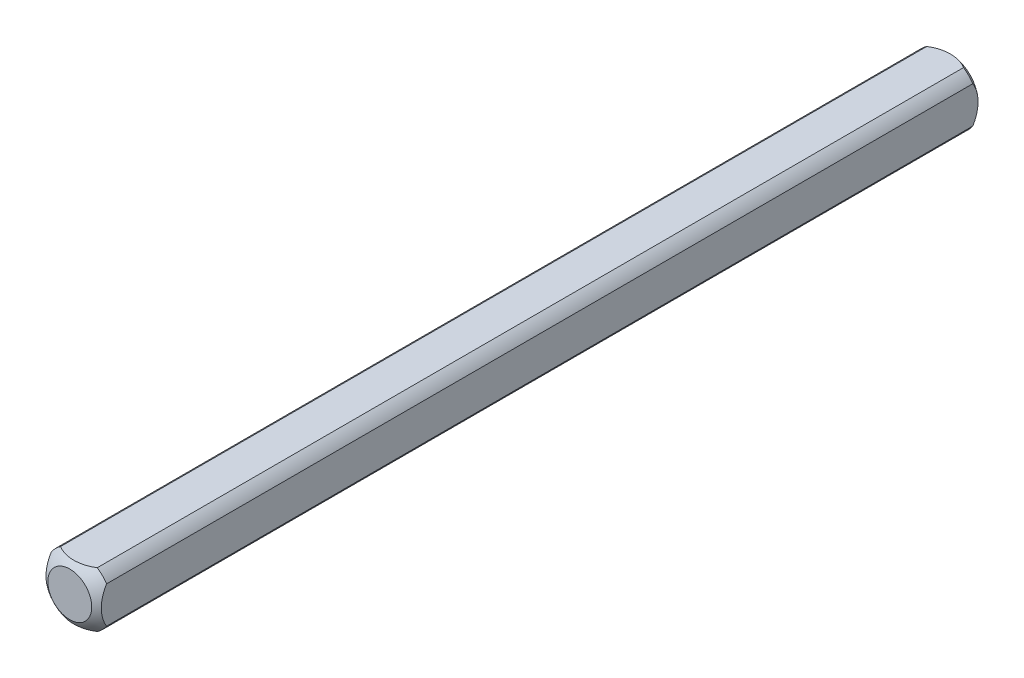
ISO-10303-21;
HEADER;
FILE_DESCRIPTION(('STEP AP214'),'2;1');
FILE_NAME('part.step','',(''),(''),'','','');
FILE_SCHEMA(('AUTOMOTIVE_DESIGN { 1 0 10303 214 1 1 1 1 }'));
ENDSEC;
DATA;
#1=APPLICATION_CONTEXT('core data for automotive mechanical design processes');
#2=APPLICATION_PROTOCOL_DEFINITION('international standard','automotive_design',2000,#1);
#3=PRODUCT_CONTEXT('',#1,'mechanical');
#4=PRODUCT('Part','Part','',(#3));
#5=PRODUCT_RELATED_PRODUCT_CATEGORY('part','',(#4));
#6=PRODUCT_DEFINITION_FORMATION('','',#4);
#7=PRODUCT_DEFINITION_CONTEXT('part definition',#1,'design');
#8=PRODUCT_DEFINITION('design','',#6,#7);
#9=PRODUCT_DEFINITION_SHAPE('','',#8);
#10=(LENGTH_UNIT() NAMED_UNIT(*) SI_UNIT(.MILLI.,.METRE.));
#11=(NAMED_UNIT(*) PLANE_ANGLE_UNIT() SI_UNIT($,.RADIAN.));
#12=(NAMED_UNIT(*) SI_UNIT($,.STERADIAN.) SOLID_ANGLE_UNIT());
#13=UNCERTAINTY_MEASURE_WITH_UNIT(LENGTH_MEASURE(1.E-05),#10,'distance_accuracy_value','');
#14=(GEOMETRIC_REPRESENTATION_CONTEXT(3) GLOBAL_UNCERTAINTY_ASSIGNED_CONTEXT((#13)) GLOBAL_UNIT_ASSIGNED_CONTEXT((#10,
#11,#12)) REPRESENTATION_CONTEXT('',''));
#15=CARTESIAN_POINT('',(0.,0.,0.));
#16=DIRECTION('',(0.,0.,1.));
#17=DIRECTION('',(1.,0.,0.));
#18=AXIS2_PLACEMENT_3D('',#15,#16,#17);
#19=CARTESIAN_POINT('',(-3.175,-3.175,50.8));
#20=DIRECTION('',(1.,0.,0.));
#21=DIRECTION('',(0.,0.,-1.));
#22=AXIS2_PLACEMENT_3D('',#19,#20,#21);
#23=PLANE('',#22);
#24=CARTESIAN_POINT('',(-3.175,0.,4.409725449428));
#25=DIRECTION('',(1.,0.,0.));
#26=DIRECTION('',(0.,0.,-1.));
#27=AXIS2_PLACEMENT_3D('',#24,#25,#26);
#28=CIRCLE('',#27,3.96557372898298);
#29=CARTESIAN_POINT('',(-3.175,-2.10605674187568,1.04962128437597));
#30=VERTEX_POINT('',#29);
#31=CARTESIAN_POINT('',(-3.175,2.10605674187568,1.04962128437597));
#32=VERTEX_POINT('',#31);
#33=EDGE_CURVE('E47',#30,#32,#28,.T.);
#34=ORIENTED_EDGE('',*,*,#33,.F.);
#35=DIRECTION('',(0.,0.,-1.));
#36=VECTOR('',#35,1.);
#37=CARTESIAN_POINT('',(-3.175,-2.10605674187568,50.8));
#38=LINE('',#37,#36);
#39=CARTESIAN_POINT('',(-3.175,-2.10605674187568,100.550378715624));
#40=VERTEX_POINT('',#39);
#41=EDGE_CURVE('E40',#40,#30,#38,.T.);
#42=ORIENTED_EDGE('',*,*,#41,.F.);
#43=CARTESIAN_POINT('',(-3.175,0.,97.190274550572));
#44=DIRECTION('',(-1.,0.,0.));
#45=DIRECTION('',(0.,0.,1.));
#46=AXIS2_PLACEMENT_3D('',#43,#44,#45);
#47=CIRCLE('',#46,3.96557372898298);
#48=CARTESIAN_POINT('',(-3.175,2.10605674187568,100.550378715624));
#49=VERTEX_POINT('',#48);
#50=EDGE_CURVE('E123',#40,#49,#47,.T.);
#51=ORIENTED_EDGE('',*,*,#50,.T.);
#52=DIRECTION('',(0.,0.,-1.));
#53=VECTOR('',#52,1.);
#54=CARTESIAN_POINT('',(-3.175,2.10605674187568,50.8));
#55=LINE('',#54,#53);
#56=EDGE_CURVE('E111',#32,#49,#55,.F.);
#57=ORIENTED_EDGE('',*,*,#56,.F.);
#58=EDGE_LOOP('',(#34,#42,#51,#57));
#59=FACE_BOUND('',#58,.T.);
#60=ADVANCED_FACE('F33',(#59),#23,.F.);
#61=CARTESIAN_POINT('',(-3.175,-3.175,50.8));
#62=DIRECTION('',(0.,1.,0.));
#63=DIRECTION('',(0.,0.,1.));
#64=AXIS2_PLACEMENT_3D('',#61,#62,#63);
#65=PLANE('',#64);
#66=CARTESIAN_POINT('',(0.,-3.175,4.409725449428));
#67=DIRECTION('',(0.,1.,0.));
#68=DIRECTION('',(0.,0.,1.));
#69=AXIS2_PLACEMENT_3D('',#66,#67,#68);
#70=CIRCLE('',#69,3.96557372898298);
#71=CARTESIAN_POINT('',(2.10605674187568,-3.175,1.04962128437597));
#72=VERTEX_POINT('',#71);
#73=CARTESIAN_POINT('',(-2.10605674187568,-3.175,1.04962128437597));
#74=VERTEX_POINT('',#73);
#75=EDGE_CURVE('E152',#72,#74,#70,.T.);
#76=ORIENTED_EDGE('',*,*,#75,.F.);
#77=DIRECTION('',(0.,0.,-1.));
#78=VECTOR('',#77,1.);
#79=CARTESIAN_POINT('',(2.10605674187568,-3.175,50.8));
#80=LINE('',#79,#78);
#81=CARTESIAN_POINT('',(2.10605674187568,-3.175,100.550378715624));
#82=VERTEX_POINT('',#81);
#83=EDGE_CURVE('E165',#82,#72,#80,.T.);
#84=ORIENTED_EDGE('',*,*,#83,.F.);
#85=CARTESIAN_POINT('',(0.,-3.175,97.190274550572));
#86=DIRECTION('',(0.,-1.,0.));
#87=DIRECTION('',(0.,0.,-1.));
#88=AXIS2_PLACEMENT_3D('',#85,#86,#87);
#89=CIRCLE('',#88,3.96557372898298);
#90=CARTESIAN_POINT('',(-2.10605674187568,-3.175,100.550378715624));
#91=VERTEX_POINT('',#90);
#92=EDGE_CURVE('E134',#82,#91,#89,.T.);
#93=ORIENTED_EDGE('',*,*,#92,.T.);
#94=DIRECTION('',(0.,0.,-1.));
#95=VECTOR('',#94,1.);
#96=CARTESIAN_POINT('',(-2.10605674187568,-3.175,50.8));
#97=LINE('',#96,#95);
#98=EDGE_CURVE('E163',#74,#91,#97,.F.);
#99=ORIENTED_EDGE('',*,*,#98,.F.);
#100=EDGE_LOOP('',(#76,#84,#93,#99));
#101=FACE_BOUND('',#100,.T.);
#102=ADVANCED_FACE('F175',(#101),#65,.F.);
#103=CARTESIAN_POINT('',(3.175,-3.175,50.8));
#104=DIRECTION('',(-1.,0.,0.));
#105=DIRECTION('',(0.,0.,1.));
#106=AXIS2_PLACEMENT_3D('',#103,#104,#105);
#107=PLANE('',#106);
#108=CARTESIAN_POINT('',(3.175,0.,4.409725449428));
#109=DIRECTION('',(-1.,0.,0.));
#110=DIRECTION('',(0.,0.,1.));
#111=AXIS2_PLACEMENT_3D('',#108,#109,#110);
#112=CIRCLE('',#111,3.96557372898298);
#113=CARTESIAN_POINT('',(3.175,2.10605674187568,1.04962128437597));
#114=VERTEX_POINT('',#113);
#115=CARTESIAN_POINT('',(3.175,-2.10605674187568,1.04962128437597));
#116=VERTEX_POINT('',#115);
#117=EDGE_CURVE('E150',#114,#116,#112,.T.);
#118=ORIENTED_EDGE('',*,*,#117,.F.);
#119=DIRECTION('',(0.,0.,-1.));
#120=VECTOR('',#119,1.);
#121=CARTESIAN_POINT('',(3.175,2.10605674187568,50.8));
#122=LINE('',#121,#120);
#123=CARTESIAN_POINT('',(3.175,2.10605674187568,100.550378715624));
#124=VERTEX_POINT('',#123);
#125=EDGE_CURVE('E160',#124,#114,#122,.T.);
#126=ORIENTED_EDGE('',*,*,#125,.F.);
#127=CARTESIAN_POINT('',(3.175,0.,97.190274550572));
#128=DIRECTION('',(1.,0.,0.));
#129=DIRECTION('',(0.,0.,-1.));
#130=AXIS2_PLACEMENT_3D('',#127,#128,#129);
#131=CIRCLE('',#130,3.96557372898298);
#132=CARTESIAN_POINT('',(3.175,-2.10605674187568,100.550378715624));
#133=VERTEX_POINT('',#132);
#134=EDGE_CURVE('E131',#124,#133,#131,.T.);
#135=ORIENTED_EDGE('',*,*,#134,.T.);
#136=DIRECTION('',(0.,0.,-1.));
#137=VECTOR('',#136,1.);
#138=CARTESIAN_POINT('',(3.175,-2.10605674187568,50.8));
#139=LINE('',#138,#137);
#140=EDGE_CURVE('E104',#116,#133,#139,.F.);
#141=ORIENTED_EDGE('',*,*,#140,.F.);
#142=EDGE_LOOP('',(#118,#126,#135,#141));
#143=FACE_BOUND('',#142,.T.);
#144=ADVANCED_FACE('F182',(#143),#107,.F.);
#145=CARTESIAN_POINT('',(-3.175,3.175,50.8));
#146=DIRECTION('',(0.,-1.,0.));
#147=DIRECTION('',(0.,0.,-1.));
#148=AXIS2_PLACEMENT_3D('',#145,#146,#147);
#149=PLANE('',#148);
#150=CARTESIAN_POINT('',(0.,3.175,4.409725449428));
#151=DIRECTION('',(0.,-1.,0.));
#152=DIRECTION('',(0.,0.,-1.));
#153=AXIS2_PLACEMENT_3D('',#150,#151,#152);
#154=CIRCLE('',#153,3.96557372898298);
#155=CARTESIAN_POINT('',(-2.10605674187568,3.175,1.04962128437597));
#156=VERTEX_POINT('',#155);
#157=CARTESIAN_POINT('',(2.10605674187568,3.175,1.04962128437597));
#158=VERTEX_POINT('',#157);
#159=EDGE_CURVE('E102',#156,#158,#154,.T.);
#160=ORIENTED_EDGE('',*,*,#159,.F.);
#161=DIRECTION('',(0.,0.,-1.));
#162=VECTOR('',#161,1.);
#163=CARTESIAN_POINT('',(-2.10605674187568,3.175,50.8));
#164=LINE('',#163,#162);
#165=CARTESIAN_POINT('',(-2.10605674187568,3.175,100.550378715624));
#166=VERTEX_POINT('',#165);
#167=EDGE_CURVE('E96',#166,#156,#164,.T.);
#168=ORIENTED_EDGE('',*,*,#167,.F.);
#169=CARTESIAN_POINT('',(0.,3.175,97.190274550572));
#170=DIRECTION('',(0.,1.,0.));
#171=DIRECTION('',(0.,0.,1.));
#172=AXIS2_PLACEMENT_3D('',#169,#170,#171);
#173=CIRCLE('',#172,3.96557372898298);
#174=CARTESIAN_POINT('',(2.10605674187568,3.175,100.550378715624));
#175=VERTEX_POINT('',#174);
#176=EDGE_CURVE('E101',#166,#175,#173,.T.);
#177=ORIENTED_EDGE('',*,*,#176,.T.);
#178=DIRECTION('',(0.,0.,-1.));
#179=VECTOR('',#178,1.);
#180=CARTESIAN_POINT('',(2.10605674187568,3.175,50.8));
#181=LINE('',#180,#179);
#182=EDGE_CURVE('E105',#158,#175,#181,.F.);
#183=ORIENTED_EDGE('',*,*,#182,.F.);
#184=EDGE_LOOP('',(#160,#168,#177,#183));
#185=FACE_BOUND('',#184,.T.);
#186=ADVANCED_FACE('F98',(#185),#149,.F.);
#187=CARTESIAN_POINT('',(0.,0.,50.8));
#188=DIRECTION('',(0.,0.,-1.));
#189=DIRECTION('',(-1.,0.,0.));
#190=AXIS2_PLACEMENT_3D('',#187,#188,#189);
#191=CYLINDRICAL_SURFACE('',#190,3.81);
#192=ORIENTED_EDGE('',*,*,#41,.T.);
#193=CARTESIAN_POINT('',(0.,0.,1.04962128437597));
#194=DIRECTION('',(0.,0.,1.));
#195=DIRECTION('',(1.,0.,0.));
#196=AXIS2_PLACEMENT_3D('',#193,#194,#195);
#197=CIRCLE('',#196,3.81);
#198=EDGE_CURVE('E147',#30,#74,#197,.T.);
#199=ORIENTED_EDGE('',*,*,#198,.T.);
#200=ORIENTED_EDGE('',*,*,#98,.T.);
#201=CARTESIAN_POINT('',(0.,0.,100.550378715624));
#202=DIRECTION('',(0.,0.,1.));
#203=DIRECTION('',(1.,0.,0.));
#204=AXIS2_PLACEMENT_3D('',#201,#202,#203);
#205=CIRCLE('',#204,3.81);
#206=EDGE_CURVE('E128',#40,#91,#205,.T.);
#207=ORIENTED_EDGE('',*,*,#206,.F.);
#208=EDGE_LOOP('',(#192,#199,#200,#207));
#209=FACE_BOUND('',#208,.T.);
#210=ADVANCED_FACE('F171',(#209),#191,.T.);
#211=ORIENTED_EDGE('',*,*,#83,.T.);
#212=CARTESIAN_POINT('',(0.,0.,1.04962128437597));
#213=DIRECTION('',(0.,0.,1.));
#214=DIRECTION('',(1.,0.,0.));
#215=AXIS2_PLACEMENT_3D('',#212,#213,#214);
#216=CIRCLE('',#215,3.81);
#217=EDGE_CURVE('E53',#72,#116,#216,.T.);
#218=ORIENTED_EDGE('',*,*,#217,.T.);
#219=ORIENTED_EDGE('',*,*,#140,.T.);
#220=CARTESIAN_POINT('',(0.,0.,100.550378715624));
#221=DIRECTION('',(0.,0.,1.));
#222=DIRECTION('',(1.,0.,0.));
#223=AXIS2_PLACEMENT_3D('',#220,#221,#222);
#224=CIRCLE('',#223,3.81);
#225=EDGE_CURVE('E137',#82,#133,#224,.T.);
#226=ORIENTED_EDGE('',*,*,#225,.F.);
#227=EDGE_LOOP('',(#211,#218,#219,#226));
#228=FACE_BOUND('',#227,.T.);
#229=ADVANCED_FACE('F178',(#228),#191,.T.);
#230=ORIENTED_EDGE('',*,*,#125,.T.);
#231=CARTESIAN_POINT('',(0.,0.,1.04962128437597));
#232=DIRECTION('',(0.,0.,1.));
#233=DIRECTION('',(1.,0.,0.));
#234=AXIS2_PLACEMENT_3D('',#231,#232,#233);
#235=CIRCLE('',#234,3.81);
#236=EDGE_CURVE('E144',#114,#158,#235,.T.);
#237=ORIENTED_EDGE('',*,*,#236,.T.);
#238=ORIENTED_EDGE('',*,*,#182,.T.);
#239=CARTESIAN_POINT('',(0.,0.,100.550378715624));
#240=DIRECTION('',(0.,0.,1.));
#241=DIRECTION('',(1.,0.,0.));
#242=AXIS2_PLACEMENT_3D('',#239,#240,#241);
#243=CIRCLE('',#242,3.81);
#244=EDGE_CURVE('E122',#124,#175,#243,.T.);
#245=ORIENTED_EDGE('',*,*,#244,.F.);
#246=EDGE_LOOP('',(#230,#237,#238,#245));
#247=FACE_BOUND('',#246,.T.);
#248=ADVANCED_FACE('F184',(#247),#191,.T.);
#249=ORIENTED_EDGE('',*,*,#167,.T.);
#250=CARTESIAN_POINT('',(0.,0.,1.04962128437597));
#251=DIRECTION('',(0.,0.,1.));
#252=DIRECTION('',(1.,0.,0.));
#253=AXIS2_PLACEMENT_3D('',#250,#251,#252);
#254=CIRCLE('',#253,3.81);
#255=EDGE_CURVE('E12',#156,#32,#254,.T.);
#256=ORIENTED_EDGE('',*,*,#255,.T.);
#257=ORIENTED_EDGE('',*,*,#56,.T.);
#258=CARTESIAN_POINT('',(0.,0.,100.550378715624));
#259=DIRECTION('',(0.,0.,1.));
#260=DIRECTION('',(1.,0.,0.));
#261=AXIS2_PLACEMENT_3D('',#258,#259,#260);
#262=CIRCLE('',#261,3.81);
#263=EDGE_CURVE('E108',#166,#49,#262,.T.);
#264=ORIENTED_EDGE('',*,*,#263,.F.);
#265=EDGE_LOOP('',(#249,#256,#257,#264));
#266=FACE_BOUND('',#265,.T.);
#267=ADVANCED_FACE('F109',(#266),#191,.T.);
#268=CARTESIAN_POINT('',(0.,0.,4.409725449428));
#269=DIRECTION('',(0.,0.,1.));
#270=DIRECTION('',(-1.,0.,0.));
#271=AXIS2_PLACEMENT_3D('',#268,#269,#270);
#272=SPHERICAL_SURFACE('',#271,5.08);
#273=CARTESIAN_POINT('',(0.,0.,0.));
#274=DIRECTION('',(0.,0.,-1.));
#275=DIRECTION('',(-1.,0.,0.));
#276=AXIS2_PLACEMENT_3D('',#273,#274,#275);
#277=CIRCLE('',#276,2.52204707740896);
#278=CARTESIAN_POINT('',(-2.52204707740896,0.,0.));
#279=VERTEX_POINT('',#278);
#280=EDGE_CURVE('E155',#279,#279,#277,.T.);
#281=ORIENTED_EDGE('',*,*,#280,.F.);
#282=EDGE_LOOP('',(#281));
#283=FACE_BOUND('',#282,.T.);
#284=ORIENTED_EDGE('',*,*,#75,.T.);
#285=ORIENTED_EDGE('',*,*,#198,.F.);
#286=ORIENTED_EDGE('',*,*,#33,.T.);
#287=ORIENTED_EDGE('',*,*,#255,.F.);
#288=ORIENTED_EDGE('',*,*,#159,.T.);
#289=ORIENTED_EDGE('',*,*,#236,.F.);
#290=ORIENTED_EDGE('',*,*,#117,.T.);
#291=ORIENTED_EDGE('',*,*,#217,.F.);
#292=EDGE_LOOP('',(#284,#285,#286,#287,#288,#289,#290,#291));
#293=FACE_BOUND('',#292,.T.);
#294=ADVANCED_FACE('F185',(#283,#293),#272,.T.);
#295=CARTESIAN_POINT('',(0.,0.,0.));
#296=DIRECTION('',(0.,0.,-1.));
#297=DIRECTION('',(-1.,0.,0.));
#298=AXIS2_PLACEMENT_3D('',#295,#296,#297);
#299=PLANE('',#298);
#300=ORIENTED_EDGE('',*,*,#280,.T.);
#301=EDGE_LOOP('',(#300));
#302=FACE_BOUND('',#301,.T.);
#303=ADVANCED_FACE('F187',(#302),#299,.T.);
#304=CARTESIAN_POINT('',(0.,0.,97.190274550572));
#305=DIRECTION('',(0.,0.,-1.));
#306=DIRECTION('',(-1.,0.,0.));
#307=AXIS2_PLACEMENT_3D('',#304,#305,#306);
#308=SPHERICAL_SURFACE('',#307,5.08);
#309=CARTESIAN_POINT('',(0.,0.,101.6));
#310=DIRECTION('',(0.,0.,-1.));
#311=DIRECTION('',(-1.,0.,0.));
#312=AXIS2_PLACEMENT_3D('',#309,#310,#311);
#313=CIRCLE('',#312,2.52204707740896);
#314=CARTESIAN_POINT('',(-2.52204707740896,0.,101.6));
#315=VERTEX_POINT('',#314);
#316=EDGE_CURVE('E115',#315,#315,#313,.T.);
#317=ORIENTED_EDGE('',*,*,#316,.T.);
#318=EDGE_LOOP('',(#317));
#319=FACE_BOUND('',#318,.T.);
#320=ORIENTED_EDGE('',*,*,#92,.F.);
#321=ORIENTED_EDGE('',*,*,#225,.T.);
#322=ORIENTED_EDGE('',*,*,#134,.F.);
#323=ORIENTED_EDGE('',*,*,#244,.T.);
#324=ORIENTED_EDGE('',*,*,#176,.F.);
#325=ORIENTED_EDGE('',*,*,#263,.T.);
#326=ORIENTED_EDGE('',*,*,#50,.F.);
#327=ORIENTED_EDGE('',*,*,#206,.T.);
#328=EDGE_LOOP('',(#320,#321,#322,#323,#324,#325,#326,#327));
#329=FACE_BOUND('',#328,.T.);
#330=ADVANCED_FACE('F119',(#319,#329),#308,.T.);
#331=CARTESIAN_POINT('',(0.,0.,101.6));
#332=DIRECTION('',(0.,0.,1.));
#333=DIRECTION('',(-1.,0.,0.));
#334=AXIS2_PLACEMENT_3D('',#331,#332,#333);
#335=PLANE('',#334);
#336=ORIENTED_EDGE('',*,*,#316,.F.);
#337=EDGE_LOOP('',(#336));
#338=FACE_BOUND('',#337,.T.);
#339=ADVANCED_FACE('F232',(#338),#335,.T.);
#340=CLOSED_SHELL('',(#60,#102,#144,#186,#210,#229,#248,#267,#294,#303,#330,#339));
#341=MANIFOLD_SOLID_BREP('B2',#340);
#342=ADVANCED_BREP_SHAPE_REPRESENTATION('',(#18,#341),#14);
#343=SHAPE_DEFINITION_REPRESENTATION(#9,#342);
ENDSEC;
END-ISO-10303-21;
